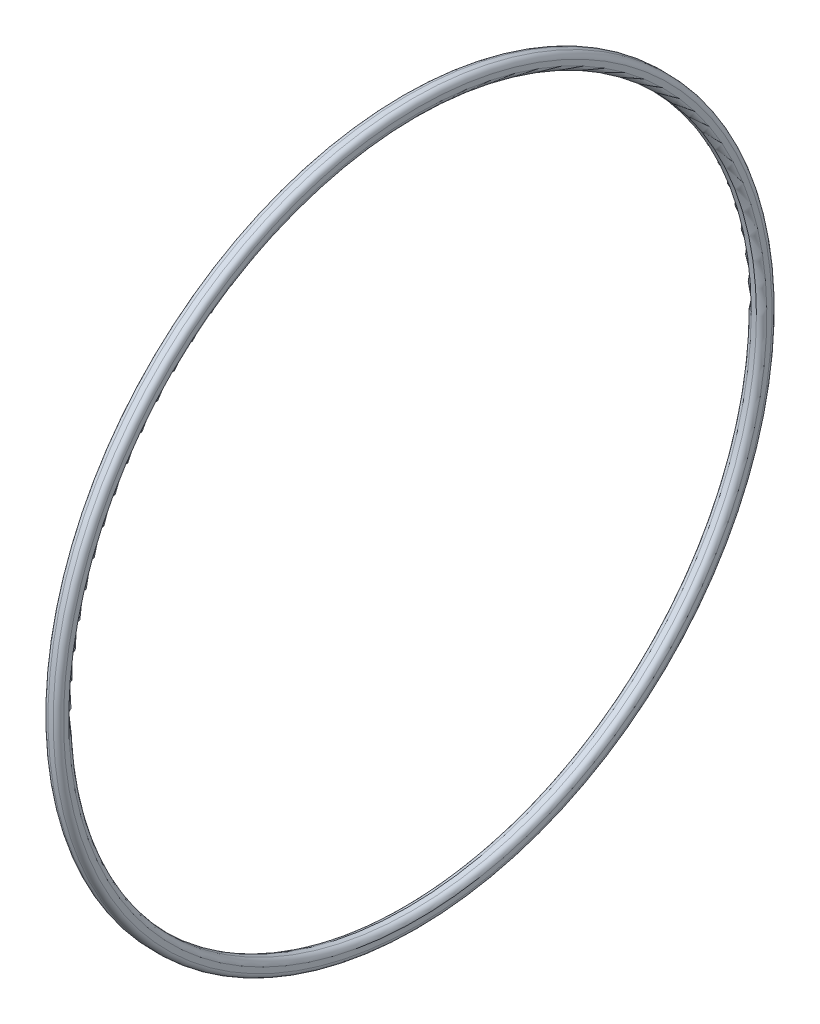
ISO-10303-21;
HEADER;
FILE_DESCRIPTION(('STEP AP214'),'2;1');
FILE_NAME('part.step','',(''),(''),'','','');
FILE_SCHEMA(('AUTOMOTIVE_DESIGN { 1 0 10303 214 1 1 1 1 }'));
ENDSEC;
DATA;
#1=APPLICATION_CONTEXT('core data for automotive mechanical design processes');
#2=APPLICATION_PROTOCOL_DEFINITION('international standard','automotive_design',2000,#1);
#3=PRODUCT_CONTEXT('',#1,'mechanical');
#4=PRODUCT('Part','Part','',(#3));
#5=PRODUCT_RELATED_PRODUCT_CATEGORY('part','',(#4));
#6=PRODUCT_DEFINITION_FORMATION('','',#4);
#7=PRODUCT_DEFINITION_CONTEXT('part definition',#1,'design');
#8=PRODUCT_DEFINITION('design','',#6,#7);
#9=PRODUCT_DEFINITION_SHAPE('','',#8);
#10=(LENGTH_UNIT() NAMED_UNIT(*) SI_UNIT(.MILLI.,.METRE.));
#11=(NAMED_UNIT(*) PLANE_ANGLE_UNIT() SI_UNIT($,.RADIAN.));
#12=(NAMED_UNIT(*) SI_UNIT($,.STERADIAN.) SOLID_ANGLE_UNIT());
#13=UNCERTAINTY_MEASURE_WITH_UNIT(LENGTH_MEASURE(1.E-05),#10,'distance_accuracy_value','');
#14=(GEOMETRIC_REPRESENTATION_CONTEXT(3) GLOBAL_UNCERTAINTY_ASSIGNED_CONTEXT((#13)) GLOBAL_UNIT_ASSIGNED_CONTEXT((#10,
#11,#12)) REPRESENTATION_CONTEXT('',''));
#15=CARTESIAN_POINT('',(0.,0.,0.));
#16=DIRECTION('',(0.,0.,1.));
#17=DIRECTION('',(1.,0.,0.));
#18=AXIS2_PLACEMENT_3D('',#15,#16,#17);
#19=CARTESIAN_POINT('',(0.49979897655043,-67.75,0.));
#20=DIRECTION('',(1.,0.,0.));
#21=DIRECTION('',(0.,1.,0.));
#22=AXIS2_PLACEMENT_3D('',#19,#20,#21);
#23=TOROIDAL_SURFACE('',#22,68.25,1.);
#24=CARTESIAN_POINT('',(0.499798976550423,-67.75,0.));
#25=DIRECTION('',(1.,0.,0.));
#26=DIRECTION('',(0.,1.,0.));
#27=AXIS2_PLACEMENT_3D('',#24,#25,#26);
#28=CIRCLE('',#27,69.25);
#29=CARTESIAN_POINT('',(0.499798976550409,1.5,0.));
#30=VERTEX_POINT('',#29);
#31=EDGE_CURVE('E59',#30,#30,#28,.T.);
#32=ORIENTED_EDGE('',*,*,#31,.T.);
#33=EDGE_LOOP('',(#32));
#34=FACE_BOUND('',#33,.T.);
#35=CARTESIAN_POINT('',(1.49979897655043,-67.75,0.));
#36=DIRECTION('',(1.,0.,0.));
#37=DIRECTION('',(0.,1.,0.));
#38=AXIS2_PLACEMENT_3D('',#35,#36,#37);
#39=CIRCLE('',#38,68.25);
#40=CARTESIAN_POINT('',(1.49979897655042,0.499999999999987,0.));
#41=VERTEX_POINT('',#40);
#42=EDGE_CURVE('E10',#41,#41,#39,.T.);
#43=ORIENTED_EDGE('',*,*,#42,.F.);
#44=EDGE_LOOP('',(#43));
#45=FACE_BOUND('',#44,.T.);
#46=ADVANCED_FACE('F31',(#34,#45),#23,.T.);
#47=CARTESIAN_POINT('',(1.49979897655042,-0.499999999999993,0.));
#48=DIRECTION('',(1.,0.,0.));
#49=DIRECTION('',(0.,1.,0.));
#50=AXIS2_PLACEMENT_3D('',#47,#48,#49);
#51=PLANE('',#50);
#52=ORIENTED_EDGE('',*,*,#42,.T.);
#53=EDGE_LOOP('',(#52));
#54=FACE_BOUND('',#53,.T.);
#55=CARTESIAN_POINT('',(1.49979897655043,-67.75,0.));
#56=DIRECTION('',(1.,0.,0.));
#57=DIRECTION('',(0.,1.,0.));
#58=AXIS2_PLACEMENT_3D('',#55,#56,#57);
#59=CIRCLE('',#58,67.25);
#60=CARTESIAN_POINT('',(1.49979897655042,-0.499999999999987,0.));
#61=VERTEX_POINT('',#60);
#62=EDGE_CURVE('E37',#61,#61,#59,.T.);
#63=ORIENTED_EDGE('',*,*,#62,.F.);
#64=EDGE_LOOP('',(#63));
#65=FACE_BOUND('',#64,.T.);
#66=ADVANCED_FACE('F77',(#54,#65),#51,.T.);
#67=CARTESIAN_POINT('',(0.49979897655043,-67.75,0.));
#68=DIRECTION('',(1.,0.,0.));
#69=DIRECTION('',(0.,1.,0.));
#70=AXIS2_PLACEMENT_3D('',#67,#68,#69);
#71=TOROIDAL_SURFACE('',#70,67.25,1.);
#72=ORIENTED_EDGE('',*,*,#62,.T.);
#73=EDGE_LOOP('',(#72));
#74=FACE_BOUND('',#73,.T.);
#75=CARTESIAN_POINT('',(0.499798976550422,-67.75,0.));
#76=DIRECTION('',(1.,0.,0.));
#77=DIRECTION('',(0.,1.,0.));
#78=AXIS2_PLACEMENT_3D('',#75,#76,#77);
#79=CIRCLE('',#78,66.25);
#80=CARTESIAN_POINT('',(0.499798976550409,-1.5,0.));
#81=VERTEX_POINT('',#80);
#82=EDGE_CURVE('E41',#81,#81,#79,.T.);
#83=ORIENTED_EDGE('',*,*,#82,.F.);
#84=EDGE_LOOP('',(#83));
#85=FACE_BOUND('',#84,.T.);
#86=ADVANCED_FACE('F81',(#74,#85),#71,.T.);
#87=CARTESIAN_POINT('',(0.,-67.75,0.));
#88=DIRECTION('',(1.,0.,0.));
#89=DIRECTION('',(0.,1.,0.));
#90=AXIS2_PLACEMENT_3D('',#87,#88,#89);
#91=CYLINDRICAL_SURFACE('',#90,66.25);
#92=ORIENTED_EDGE('',*,*,#82,.T.);
#93=EDGE_LOOP('',(#92));
#94=FACE_BOUND('',#93,.T.);
#95=CARTESIAN_POINT('',(-0.499798976550395,-67.75,0.));
#96=DIRECTION('',(1.,0.,0.));
#97=DIRECTION('',(0.,1.,0.));
#98=AXIS2_PLACEMENT_3D('',#95,#96,#97);
#99=CIRCLE('',#98,66.25);
#100=CARTESIAN_POINT('',(-0.499798976550408,-1.5,0.));
#101=VERTEX_POINT('',#100);
#102=EDGE_CURVE('E45',#101,#101,#99,.T.);
#103=ORIENTED_EDGE('',*,*,#102,.F.);
#104=EDGE_LOOP('',(#103));
#105=FACE_BOUND('',#104,.T.);
#106=ADVANCED_FACE('F85',(#94,#105),#91,.F.);
#107=CARTESIAN_POINT('',(-0.499798976550402,-67.75,0.));
#108=DIRECTION('',(1.,0.,0.));
#109=DIRECTION('',(0.,1.,0.));
#110=AXIS2_PLACEMENT_3D('',#107,#108,#109);
#111=TOROIDAL_SURFACE('',#110,67.25,1.);
#112=ORIENTED_EDGE('',*,*,#102,.T.);
#113=EDGE_LOOP('',(#112));
#114=FACE_BOUND('',#113,.T.);
#115=CARTESIAN_POINT('',(-1.4997989765504,-67.75,0.));
#116=DIRECTION('',(1.,0.,0.));
#117=DIRECTION('',(0.,1.,0.));
#118=AXIS2_PLACEMENT_3D('',#115,#116,#117);
#119=CIRCLE('',#118,67.25);
#120=CARTESIAN_POINT('',(-1.49979897655042,-0.499999999999987,0.));
#121=VERTEX_POINT('',#120);
#122=EDGE_CURVE('E50',#121,#121,#119,.T.);
#123=ORIENTED_EDGE('',*,*,#122,.F.);
#124=EDGE_LOOP('',(#123));
#125=FACE_BOUND('',#124,.T.);
#126=ADVANCED_FACE('F91',(#114,#125),#111,.T.);
#127=CARTESIAN_POINT('',(-1.49979897655042,-0.499999999999993,0.));
#128=DIRECTION('',(-1.,0.,0.));
#129=DIRECTION('',(0.,-1.,0.));
#130=AXIS2_PLACEMENT_3D('',#127,#128,#129);
#131=PLANE('',#130);
#132=ORIENTED_EDGE('',*,*,#122,.T.);
#133=EDGE_LOOP('',(#132));
#134=FACE_BOUND('',#133,.T.);
#135=CARTESIAN_POINT('',(-1.4997989765504,-67.75,0.));
#136=DIRECTION('',(1.,0.,0.));
#137=DIRECTION('',(0.,1.,0.));
#138=AXIS2_PLACEMENT_3D('',#135,#136,#137);
#139=CIRCLE('',#138,68.25);
#140=CARTESIAN_POINT('',(-1.49979897655042,0.499999999999987,0.));
#141=VERTEX_POINT('',#140);
#142=EDGE_CURVE('E53',#141,#141,#139,.T.);
#143=ORIENTED_EDGE('',*,*,#142,.F.);
#144=EDGE_LOOP('',(#143));
#145=FACE_BOUND('',#144,.T.);
#146=ADVANCED_FACE('F73',(#134,#145),#131,.T.);
#147=CARTESIAN_POINT('',(-0.499798976550402,-67.75,0.));
#148=DIRECTION('',(1.,0.,0.));
#149=DIRECTION('',(0.,1.,0.));
#150=AXIS2_PLACEMENT_3D('',#147,#148,#149);
#151=TOROIDAL_SURFACE('',#150,68.25,1.);
#152=ORIENTED_EDGE('',*,*,#142,.T.);
#153=EDGE_LOOP('',(#152));
#154=FACE_BOUND('',#153,.T.);
#155=CARTESIAN_POINT('',(-0.499798976550394,-67.75,0.));
#156=DIRECTION('',(1.,0.,0.));
#157=DIRECTION('',(0.,1.,0.));
#158=AXIS2_PLACEMENT_3D('',#155,#156,#157);
#159=CIRCLE('',#158,69.25);
#160=CARTESIAN_POINT('',(-0.499798976550408,1.5,0.));
#161=VERTEX_POINT('',#160);
#162=EDGE_CURVE('E56',#161,#161,#159,.T.);
#163=ORIENTED_EDGE('',*,*,#162,.F.);
#164=EDGE_LOOP('',(#163));
#165=FACE_BOUND('',#164,.T.);
#166=ADVANCED_FACE('F67',(#154,#165),#151,.T.);
#167=CARTESIAN_POINT('',(0.,-67.75,0.));
#168=DIRECTION('',(1.,0.,0.));
#169=DIRECTION('',(0.,1.,0.));
#170=AXIS2_PLACEMENT_3D('',#167,#168,#169);
#171=CYLINDRICAL_SURFACE('',#170,69.25);
#172=ORIENTED_EDGE('',*,*,#162,.T.);
#173=EDGE_LOOP('',(#172));
#174=FACE_BOUND('',#173,.T.);
#175=ORIENTED_EDGE('',*,*,#31,.F.);
#176=EDGE_LOOP('',(#175));
#177=FACE_BOUND('',#176,.T.);
#178=ADVANCED_FACE('F65',(#174,#177),#171,.T.);
#179=CLOSED_SHELL('',(#46,#66,#86,#106,#126,#146,#166,#178));
#180=MANIFOLD_SOLID_BREP('B2',#179);
#181=ADVANCED_BREP_SHAPE_REPRESENTATION('',(#18,#180),#14);
#182=SHAPE_DEFINITION_REPRESENTATION(#9,#181);
ENDSEC;
END-ISO-10303-21;
